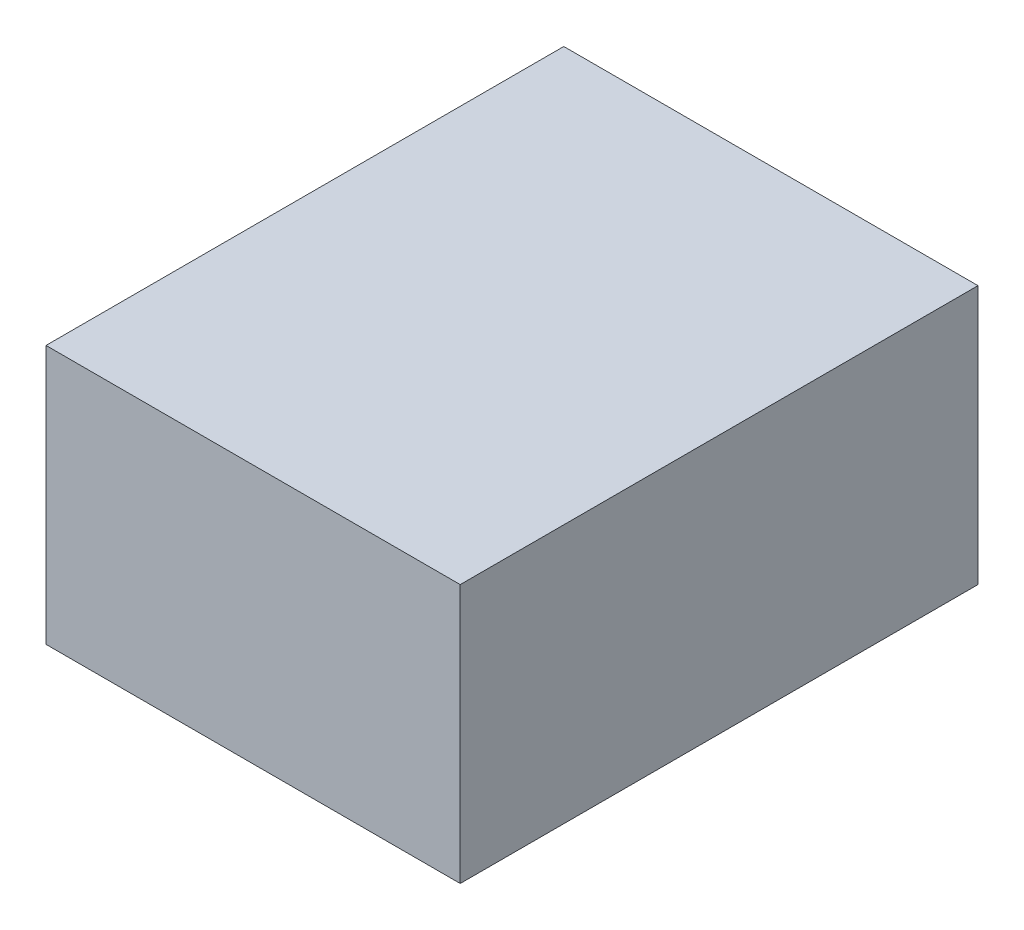
ISO-10303-21;
HEADER;
FILE_DESCRIPTION(('STEP AP214'),'2;1');
FILE_NAME('part.step','',(''),(''),'','','');
FILE_SCHEMA(('AUTOMOTIVE_DESIGN { 1 0 10303 214 1 1 1 1 }'));
ENDSEC;
DATA;
#1=APPLICATION_CONTEXT('core data for automotive mechanical design processes');
#2=APPLICATION_PROTOCOL_DEFINITION('international standard','automotive_design',2000,#1);
#3=PRODUCT_CONTEXT('',#1,'mechanical');
#4=PRODUCT('Part','Part','',(#3));
#5=PRODUCT_RELATED_PRODUCT_CATEGORY('part','',(#4));
#6=PRODUCT_DEFINITION_FORMATION('','',#4);
#7=PRODUCT_DEFINITION_CONTEXT('part definition',#1,'design');
#8=PRODUCT_DEFINITION('design','',#6,#7);
#9=PRODUCT_DEFINITION_SHAPE('','',#8);
#10=(LENGTH_UNIT() NAMED_UNIT(*) SI_UNIT(.MILLI.,.METRE.));
#11=(NAMED_UNIT(*) PLANE_ANGLE_UNIT() SI_UNIT($,.RADIAN.));
#12=(NAMED_UNIT(*) SI_UNIT($,.STERADIAN.) SOLID_ANGLE_UNIT());
#13=UNCERTAINTY_MEASURE_WITH_UNIT(LENGTH_MEASURE(1.E-05),#10,'distance_accuracy_value','');
#14=(GEOMETRIC_REPRESENTATION_CONTEXT(3) GLOBAL_UNCERTAINTY_ASSIGNED_CONTEXT((#13)) GLOBAL_UNIT_ASSIGNED_CONTEXT((#10,
#11,#12)) REPRESENTATION_CONTEXT('',''));
#15=CARTESIAN_POINT('',(0.,0.,0.));
#16=DIRECTION('',(0.,0.,1.));
#17=DIRECTION('',(1.,0.,0.));
#18=AXIS2_PLACEMENT_3D('',#15,#16,#17);
#19=CARTESIAN_POINT('',(20.,28.,25.));
#20=DIRECTION('',(-1.,0.,0.));
#21=DIRECTION('',(0.,0.,1.));
#22=AXIS2_PLACEMENT_3D('',#19,#20,#21);
#23=PLANE('',#22);
#24=DIRECTION('',(0.,0.,-1.));
#25=VECTOR('',#24,1.);
#26=CARTESIAN_POINT('',(20.,3.,25.));
#27=LINE('',#26,#25);
#28=CARTESIAN_POINT('',(20.,3.,25.));
#29=VERTEX_POINT('',#28);
#30=CARTESIAN_POINT('',(20.,3.,-25.));
#31=VERTEX_POINT('',#30);
#32=EDGE_CURVE('E96',#29,#31,#27,.T.);
#33=ORIENTED_EDGE('',*,*,#32,.T.);
#34=DIRECTION('',(0.,-1.,0.));
#35=VECTOR('',#34,1.);
#36=CARTESIAN_POINT('',(20.,28.,-25.));
#37=LINE('',#36,#35);
#38=CARTESIAN_POINT('',(20.,28.,-25.));
#39=VERTEX_POINT('',#38);
#40=EDGE_CURVE('E11',#39,#31,#37,.T.);
#41=ORIENTED_EDGE('',*,*,#40,.F.);
#42=DIRECTION('',(0.,0.,-1.));
#43=VECTOR('',#42,1.);
#44=CARTESIAN_POINT('',(20.,28.,25.));
#45=LINE('',#44,#43);
#46=CARTESIAN_POINT('',(20.,28.,25.));
#47=VERTEX_POINT('',#46);
#48=EDGE_CURVE('E84',#47,#39,#45,.T.);
#49=ORIENTED_EDGE('',*,*,#48,.F.);
#50=DIRECTION('',(0.,-1.,0.));
#51=VECTOR('',#50,1.);
#52=CARTESIAN_POINT('',(20.,28.,25.));
#53=LINE('',#52,#51);
#54=EDGE_CURVE('E92',#47,#29,#53,.T.);
#55=ORIENTED_EDGE('',*,*,#54,.T.);
#56=EDGE_LOOP('',(#33,#41,#49,#55));
#57=FACE_BOUND('',#56,.T.);
#58=ADVANCED_FACE('F33',(#57),#23,.F.);
#59=CARTESIAN_POINT('',(-20.,28.,-25.));
#60=DIRECTION('',(0.,0.,1.));
#61=DIRECTION('',(1.,0.,0.));
#62=AXIS2_PLACEMENT_3D('',#59,#60,#61);
#63=PLANE('',#62);
#64=DIRECTION('',(-1.,0.,0.));
#65=VECTOR('',#64,1.);
#66=CARTESIAN_POINT('',(-20.,3.,-25.));
#67=LINE('',#66,#65);
#68=CARTESIAN_POINT('',(-20.,3.,-25.));
#69=VERTEX_POINT('',#68);
#70=EDGE_CURVE('E88',#31,#69,#67,.T.);
#71=ORIENTED_EDGE('',*,*,#70,.T.);
#72=DIRECTION('',(0.,-1.,0.));
#73=VECTOR('',#72,1.);
#74=CARTESIAN_POINT('',(-20.,28.,-25.));
#75=LINE('',#74,#73);
#76=CARTESIAN_POINT('',(-20.,28.,-25.));
#77=VERTEX_POINT('',#76);
#78=EDGE_CURVE('E41',#77,#69,#75,.T.);
#79=ORIENTED_EDGE('',*,*,#78,.F.);
#80=DIRECTION('',(-1.,0.,0.));
#81=VECTOR('',#80,1.);
#82=CARTESIAN_POINT('',(-20.,28.,-25.));
#83=LINE('',#82,#81);
#84=EDGE_CURVE('E79',#39,#77,#83,.T.);
#85=ORIENTED_EDGE('',*,*,#84,.F.);
#86=ORIENTED_EDGE('',*,*,#40,.T.);
#87=EDGE_LOOP('',(#71,#79,#85,#86));
#88=FACE_BOUND('',#87,.T.);
#89=ADVANCED_FACE('F87',(#88),#63,.F.);
#90=CARTESIAN_POINT('',(-20.,28.,25.));
#91=DIRECTION('',(1.,0.,0.));
#92=DIRECTION('',(0.,0.,-1.));
#93=AXIS2_PLACEMENT_3D('',#90,#91,#92);
#94=PLANE('',#93);
#95=DIRECTION('',(0.,0.,1.));
#96=VECTOR('',#95,1.);
#97=CARTESIAN_POINT('',(-20.,3.,25.));
#98=LINE('',#97,#96);
#99=CARTESIAN_POINT('',(-20.,3.,25.));
#100=VERTEX_POINT('',#99);
#101=EDGE_CURVE('E66',#69,#100,#98,.T.);
#102=ORIENTED_EDGE('',*,*,#101,.T.);
#103=DIRECTION('',(0.,-1.,0.));
#104=VECTOR('',#103,1.);
#105=CARTESIAN_POINT('',(-20.,28.,25.));
#106=LINE('',#105,#104);
#107=CARTESIAN_POINT('',(-20.,28.,25.));
#108=VERTEX_POINT('',#107);
#109=EDGE_CURVE('E89',#108,#100,#106,.T.);
#110=ORIENTED_EDGE('',*,*,#109,.F.);
#111=DIRECTION('',(0.,0.,1.));
#112=VECTOR('',#111,1.);
#113=CARTESIAN_POINT('',(-20.,28.,25.));
#114=LINE('',#113,#112);
#115=EDGE_CURVE('E82',#77,#108,#114,.T.);
#116=ORIENTED_EDGE('',*,*,#115,.F.);
#117=ORIENTED_EDGE('',*,*,#78,.T.);
#118=EDGE_LOOP('',(#102,#110,#116,#117));
#119=FACE_BOUND('',#118,.T.);
#120=ADVANCED_FACE('F90',(#119),#94,.F.);
#121=CARTESIAN_POINT('',(-20.,28.,25.));
#122=DIRECTION('',(0.,0.,-1.));
#123=DIRECTION('',(-1.,0.,0.));
#124=AXIS2_PLACEMENT_3D('',#121,#122,#123);
#125=PLANE('',#124);
#126=DIRECTION('',(1.,0.,0.));
#127=VECTOR('',#126,1.);
#128=CARTESIAN_POINT('',(-20.,3.,25.));
#129=LINE('',#128,#127);
#130=EDGE_CURVE('E72',#100,#29,#129,.T.);
#131=ORIENTED_EDGE('',*,*,#130,.T.);
#132=ORIENTED_EDGE('',*,*,#54,.F.);
#133=DIRECTION('',(1.,0.,0.));
#134=VECTOR('',#133,1.);
#135=CARTESIAN_POINT('',(-20.,28.,25.));
#136=LINE('',#135,#134);
#137=EDGE_CURVE('E49',#108,#47,#136,.T.);
#138=ORIENTED_EDGE('',*,*,#137,.F.);
#139=ORIENTED_EDGE('',*,*,#109,.T.);
#140=EDGE_LOOP('',(#131,#132,#138,#139));
#141=FACE_BOUND('',#140,.T.);
#142=ADVANCED_FACE('F103',(#141),#125,.F.);
#143=CARTESIAN_POINT('',(0.,28.,0.));
#144=DIRECTION('',(0.,-1.,0.));
#145=DIRECTION('',(0.,0.,-1.));
#146=AXIS2_PLACEMENT_3D('',#143,#144,#145);
#147=PLANE('',#146);
#148=ORIENTED_EDGE('',*,*,#48,.T.);
#149=ORIENTED_EDGE('',*,*,#84,.T.);
#150=ORIENTED_EDGE('',*,*,#115,.T.);
#151=ORIENTED_EDGE('',*,*,#137,.T.);
#152=EDGE_LOOP('',(#148,#149,#150,#151));
#153=FACE_BOUND('',#152,.T.);
#154=ADVANCED_FACE('F80',(#153),#147,.F.);
#155=CARTESIAN_POINT('',(0.,3.,0.));
#156=DIRECTION('',(0.,-1.,0.));
#157=DIRECTION('',(0.,0.,-1.));
#158=AXIS2_PLACEMENT_3D('',#155,#156,#157);
#159=PLANE('',#158);
#160=ORIENTED_EDGE('',*,*,#32,.F.);
#161=ORIENTED_EDGE('',*,*,#130,.F.);
#162=ORIENTED_EDGE('',*,*,#101,.F.);
#163=ORIENTED_EDGE('',*,*,#70,.F.);
#164=EDGE_LOOP('',(#160,#161,#162,#163));
#165=FACE_BOUND('',#164,.T.);
#166=ADVANCED_FACE('F106',(#165),#159,.T.);
#167=CLOSED_SHELL('',(#58,#89,#120,#142,#154,#166));
#168=MANIFOLD_SOLID_BREP('B2',#167);
#169=ADVANCED_BREP_SHAPE_REPRESENTATION('',(#18,#168),#14);
#170=SHAPE_DEFINITION_REPRESENTATION(#9,#169);
ENDSEC;
END-ISO-10303-21;
